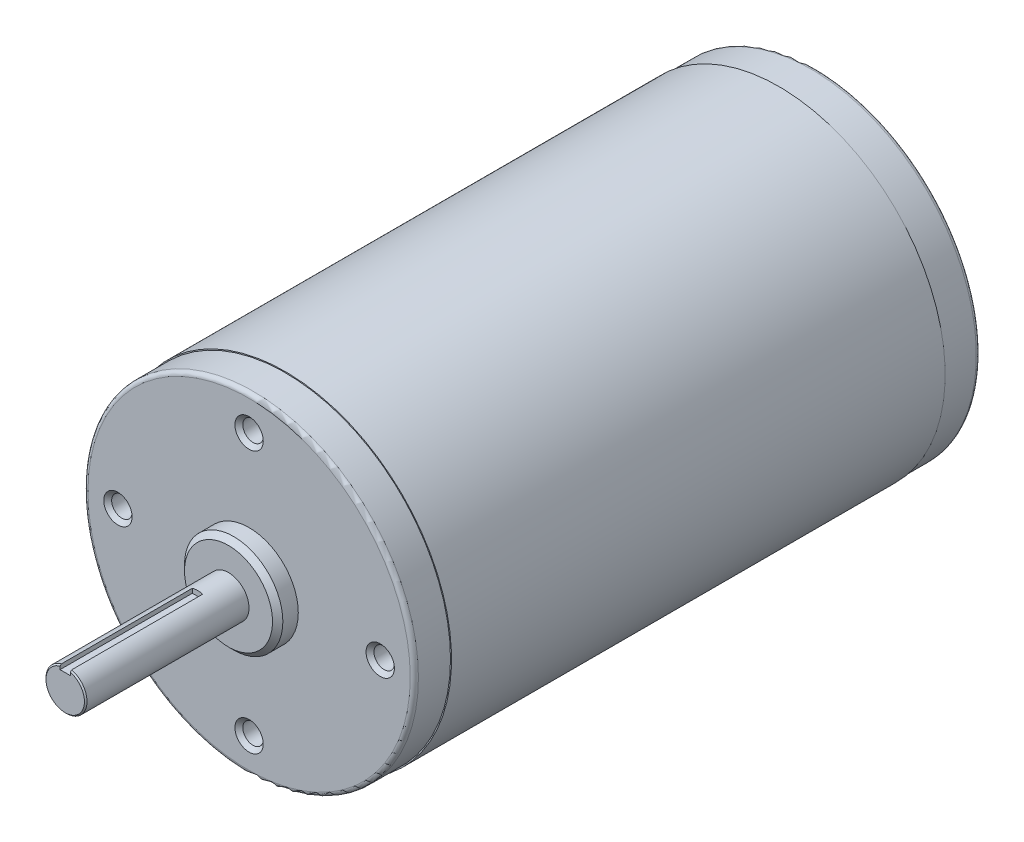
ISO-10303-21;
HEADER;
FILE_DESCRIPTION(('STEP AP214'),'2;1');
FILE_NAME('part.step','',(''),(''),'','','');
FILE_SCHEMA(('AUTOMOTIVE_DESIGN { 1 0 10303 214 1 1 1 1 }'));
ENDSEC;
DATA;
#1=APPLICATION_CONTEXT('core data for automotive mechanical design processes');
#2=APPLICATION_PROTOCOL_DEFINITION('international standard','automotive_design',2000,#1);
#3=PRODUCT_CONTEXT('',#1,'mechanical');
#4=PRODUCT('Part','Part','',(#3));
#5=PRODUCT_RELATED_PRODUCT_CATEGORY('part','',(#4));
#6=PRODUCT_DEFINITION_FORMATION('','',#4);
#7=PRODUCT_DEFINITION_CONTEXT('part definition',#1,'design');
#8=PRODUCT_DEFINITION('design','',#6,#7);
#9=PRODUCT_DEFINITION_SHAPE('','',#8);
#10=(LENGTH_UNIT() NAMED_UNIT(*) SI_UNIT(.MILLI.,.METRE.));
#11=(NAMED_UNIT(*) PLANE_ANGLE_UNIT() SI_UNIT($,.RADIAN.));
#12=(NAMED_UNIT(*) SI_UNIT($,.STERADIAN.) SOLID_ANGLE_UNIT());
#13=UNCERTAINTY_MEASURE_WITH_UNIT(LENGTH_MEASURE(1.E-05),#10,'distance_accuracy_value','');
#14=(GEOMETRIC_REPRESENTATION_CONTEXT(3) GLOBAL_UNCERTAINTY_ASSIGNED_CONTEXT((#13)) GLOBAL_UNIT_ASSIGNED_CONTEXT((#10,
#11,#12)) REPRESENTATION_CONTEXT('',''));
#15=CARTESIAN_POINT('',(0.,0.,0.));
#16=DIRECTION('',(0.,0.,1.));
#17=DIRECTION('',(1.,0.,0.));
#18=AXIS2_PLACEMENT_3D('',#15,#16,#17);
#19=CARTESIAN_POINT('',(-0.999999999999988,2.99999999999999,42.6108));
#20=DIRECTION('',(0.,-1.,0.));
#21=DIRECTION('',(0.,0.,-1.));
#22=AXIS2_PLACEMENT_3D('',#19,#20,#21);
#23=PLANE('',#22);
#24=DIRECTION('',(0.,0.,1.));
#25=VECTOR('',#24,1.);
#26=CARTESIAN_POINT('',(-0.999999999999988,2.99999999999999,42.6108));
#27=LINE('',#26,#25);
#28=CARTESIAN_POINT('',(-0.999999999999988,2.99999999999999,16.9822));
#29=VERTEX_POINT('',#28);
#30=CARTESIAN_POINT('',(-0.999999999999988,2.99999999999999,42.6108));
#31=VERTEX_POINT('',#30);
#32=EDGE_CURVE('E134',#29,#31,#27,.T.);
#33=ORIENTED_EDGE('',*,*,#32,.T.);
#34=DIRECTION('',(-1.,0.,0.));
#35=VECTOR('',#34,1.);
#36=CARTESIAN_POINT('',(0.,2.99999999999999,42.6108));
#37=LINE('',#36,#35);
#38=CARTESIAN_POINT('',(1.00000000000001,2.99999999999999,42.6108));
#39=VERTEX_POINT('',#38);
#40=EDGE_CURVE('E132',#31,#39,#37,.F.);
#41=ORIENTED_EDGE('',*,*,#40,.T.);
#42=DIRECTION('',(0.,0.,-1.));
#43=VECTOR('',#42,1.);
#44=CARTESIAN_POINT('',(1.00000000000001,2.99999999999999,42.6108));
#45=LINE('',#44,#43);
#46=CARTESIAN_POINT('',(1.00000000000001,2.99999999999999,16.9822));
#47=VERTEX_POINT('',#46);
#48=EDGE_CURVE('E121',#39,#47,#45,.T.);
#49=ORIENTED_EDGE('',*,*,#48,.T.);
#50=DIRECTION('',(1.,0.,0.));
#51=VECTOR('',#50,1.);
#52=CARTESIAN_POINT('',(0.,2.99999999999999,16.9822));
#53=LINE('',#52,#51);
#54=EDGE_CURVE('E101',#29,#47,#53,.T.);
#55=ORIENTED_EDGE('',*,*,#54,.F.);
#56=EDGE_LOOP('',(#33,#41,#49,#55));
#57=FACE_BOUND('',#56,.T.);
#58=ADVANCED_FACE('F15',(#57),#23,.F.);
#59=CARTESIAN_POINT('',(0.,0.,42.6108));
#60=DIRECTION('',(0.,0.,-1.));
#61=DIRECTION('',(-1.,0.,0.));
#62=AXIS2_PLACEMENT_3D('',#59,#60,#61);
#63=PLANE('',#62);
#64=DIRECTION('',(0.,1.,0.));
#65=VECTOR('',#64,1.);
#66=CARTESIAN_POINT('',(1.00000000000001,2.99999999999999,42.6108));
#67=LINE('',#66,#65);
#68=CARTESIAN_POINT('',(1.00000000000001,3.58836592498397,42.6108000000454));
#69=VERTEX_POINT('',#68);
#70=EDGE_CURVE('E118',#69,#39,#67,.F.);
#71=ORIENTED_EDGE('',*,*,#70,.T.);
#72=ORIENTED_EDGE('',*,*,#40,.F.);
#73=DIRECTION('',(0.,1.,0.));
#74=VECTOR('',#73,1.);
#75=CARTESIAN_POINT('',(-0.999999999999988,3.84726136491921,42.6108));
#76=LINE('',#75,#74);
#77=CARTESIAN_POINT('',(-0.999999999999988,3.58836592498397,42.6108000000454));
#78=VERTEX_POINT('',#77);
#79=EDGE_CURVE('E102',#31,#78,#76,.T.);
#80=ORIENTED_EDGE('',*,*,#79,.T.);
#81=CARTESIAN_POINT('',(0.,0.,42.6108000000909));
#82=DIRECTION('',(0.,0.,-1.));
#83=DIRECTION('',(-1.,0.,0.));
#84=AXIS2_PLACEMENT_3D('',#81,#82,#83);
#85=CIRCLE('',#84,3.72510000016746);
#86=EDGE_CURVE('E97',#69,#78,#85,.T.);
#87=ORIENTED_EDGE('',*,*,#86,.F.);
#88=EDGE_LOOP('',(#71,#72,#80,#87));
#89=FACE_BOUND('',#88,.T.);
#90=ADVANCED_FACE('F793',(#89),#63,.F.);
#91=CARTESIAN_POINT('',(-0.999999999999988,3.84726136491921,42.6108));
#92=DIRECTION('',(-1.,0.,0.));
#93=DIRECTION('',(0.,0.,1.));
#94=AXIS2_PLACEMENT_3D('',#91,#92,#93);
#95=PLANE('',#94);
#96=ORIENTED_EDGE('',*,*,#79,.F.);
#97=ORIENTED_EDGE('',*,*,#32,.F.);
#98=DIRECTION('',(0.,1.,0.));
#99=VECTOR('',#98,1.);
#100=CARTESIAN_POINT('',(-0.999999999999988,3.45234055060212,16.9822));
#101=LINE('',#100,#99);
#102=CARTESIAN_POINT('',(-0.999999999999988,3.84726136491921,16.9822));
#103=VERTEX_POINT('',#102);
#104=EDGE_CURVE('E107',#103,#29,#101,.F.);
#105=ORIENTED_EDGE('',*,*,#104,.F.);
#106=DIRECTION('',(0.,0.,1.));
#107=VECTOR('',#106,1.);
#108=CARTESIAN_POINT('',(-0.999999999999988,3.84726136491921,10.9878));
#109=LINE('',#108,#107);
#110=CARTESIAN_POINT('',(-0.999999999999988,3.84726136487013,42.3607999999493));
#111=VERTEX_POINT('',#110);
#112=EDGE_CURVE('E85',#111,#103,#109,.F.);
#113=ORIENTED_EDGE('',*,*,#112,.F.);
#114=CARTESIAN_POINT('',(-0.999999999958643,3.5883659248844,42.610800000094));
#115=CARTESIAN_POINT('',(-0.999999999979315,3.6315641260689,42.5691840357475));
#116=CARTESIAN_POINT('',(-0.999999999993097,3.67473784689741,42.5275427199908));
#117=CARTESIAN_POINT('',(-1.00000000000688,3.76103632687519,42.4442093865912));
#118=CARTESIAN_POINT('',(-1.00000000000688,3.80416108602558,42.4025173689494));
#119=CARTESIAN_POINT('',(-0.999999999999988,3.84726136482105,42.3607999998986));
#120=B_SPLINE_CURVE_WITH_KNOTS('',3,(#114,#115,#116,#117,#118,#119),.UNSPECIFIED.,.F.,.F.,(4,2,
4),(0.,0.179949226542119,0.359898449050626),.UNSPECIFIED.);
#121=EDGE_CURVE('E95',#78,#111,#120,.T.);
#122=ORIENTED_EDGE('',*,*,#121,.F.);
#123=EDGE_LOOP('',(#96,#97,#105,#113,#122));
#124=FACE_BOUND('',#123,.T.);
#125=ADVANCED_FACE('F104',(#124),#95,.F.);
#126=CARTESIAN_POINT('',(0.,3.45234055060212,16.9822));
#127=DIRECTION('',(0.,0.,1.));
#128=DIRECTION('',(1.,0.,0.));
#129=AXIS2_PLACEMENT_3D('',#126,#127,#128);
#130=PLANE('',#129);
#131=CARTESIAN_POINT('',(0.,0.,16.9822));
#132=DIRECTION('',(0.,0.,1.));
#133=DIRECTION('',(1.,0.,0.));
#134=AXIS2_PLACEMENT_3D('',#131,#132,#133);
#135=CIRCLE('',#134,3.9751);
#136=CARTESIAN_POINT('',(1.00000000000001,3.8472613649192,16.9822));
#137=VERTEX_POINT('',#136);
#138=EDGE_CURVE('E109',#103,#137,#135,.F.);
#139=ORIENTED_EDGE('',*,*,#138,.F.);
#140=ORIENTED_EDGE('',*,*,#104,.T.);
#141=ORIENTED_EDGE('',*,*,#54,.T.);
#142=DIRECTION('',(0.,1.,0.));
#143=VECTOR('',#142,1.);
#144=CARTESIAN_POINT('',(1.00000000000001,2.99999999999999,16.9822));
#145=LINE('',#144,#143);
#146=EDGE_CURVE('E129',#47,#137,#145,.T.);
#147=ORIENTED_EDGE('',*,*,#146,.T.);
#148=EDGE_LOOP('',(#139,#140,#141,#147));
#149=FACE_BOUND('',#148,.T.);
#150=ADVANCED_FACE('F768',(#149),#130,.T.);
#151=CARTESIAN_POINT('',(1.00000000000001,2.99999999999999,42.6108));
#152=DIRECTION('',(1.,0.,0.));
#153=DIRECTION('',(0.,0.,-1.));
#154=AXIS2_PLACEMENT_3D('',#151,#152,#153);
#155=PLANE('',#154);
#156=DIRECTION('',(0.,0.,1.));
#157=VECTOR('',#156,1.);
#158=CARTESIAN_POINT('',(1.00000000000001,3.8472613649192,10.9878));
#159=LINE('',#158,#157);
#160=CARTESIAN_POINT('',(1.00000000000001,3.84726136487822,42.3607999999415));
#161=VERTEX_POINT('',#160);
#162=EDGE_CURVE('E87',#137,#161,#159,.T.);
#163=ORIENTED_EDGE('',*,*,#162,.F.);
#164=ORIENTED_EDGE('',*,*,#146,.F.);
#165=ORIENTED_EDGE('',*,*,#48,.F.);
#166=ORIENTED_EDGE('',*,*,#70,.F.);
#167=CARTESIAN_POINT('',(1.00000000000001,3.84726136483723,42.3607999998829));
#168=CARTESIAN_POINT('',(1.00000000000001,3.80416108603627,42.4025173689311));
#169=CARTESIAN_POINT('',(1.00000000000001,3.76103632688435,42.4442093865744));
#170=CARTESIAN_POINT('',(1.00000000000001,3.67473784691138,42.5275427199852));
#171=CARTESIAN_POINT('',(1.00000000000001,3.63156412608924,42.5691840357516));
#172=CARTESIAN_POINT('',(1.00000000000001,3.58836592491504,42.6108000001118));
#173=B_SPLINE_CURVE_WITH_KNOTS('',3,(#167,#168,#169,#170,#171,#172),.UNSPECIFIED.,.F.,.F.,(4,2,
4),(0.,0.179949222514937,0.359898449063476),.UNSPECIFIED.);
#174=EDGE_CURVE('E112',#161,#69,#173,.T.);
#175=ORIENTED_EDGE('',*,*,#174,.F.);
#176=EDGE_LOOP('',(#163,#164,#165,#166,#175));
#177=FACE_BOUND('',#176,.T.);
#178=ADVANCED_FACE('F218',(#177),#155,.F.);
#179=CARTESIAN_POINT('',(0.,0.,42.3607999999831));
#180=DIRECTION('',(0.,0.,-1.));
#181=DIRECTION('',(-1.,0.,0.));
#182=AXIS2_PLACEMENT_3D('',#179,#180,#181);
#183=CONICAL_SURFACE('',#182,3.97509999982049,0.785398162487954);
#184=CARTESIAN_POINT('',(0.,0.,42.3608));
#185=DIRECTION('',(0.,0.,1.));
#186=DIRECTION('',(1.,0.,0.));
#187=AXIS2_PLACEMENT_3D('',#184,#185,#186);
#188=CIRCLE('',#187,3.9751);
#189=EDGE_CURVE('E80',#161,#111,#188,.F.);
#190=ORIENTED_EDGE('',*,*,#189,.F.);
#191=ORIENTED_EDGE('',*,*,#174,.T.);
#192=ORIENTED_EDGE('',*,*,#86,.T.);
#193=ORIENTED_EDGE('',*,*,#121,.T.);
#194=EDGE_LOOP('',(#190,#191,#192,#193));
#195=FACE_BOUND('',#194,.T.);
#196=ADVANCED_FACE('F96',(#195),#183,.T.);
#197=CARTESIAN_POINT('',(0.,25.4,-98.0336));
#198=DIRECTION('',(0.,0.,1.));
#199=DIRECTION('',(1.,0.,0.));
#200=AXIS2_PLACEMENT_3D('',#197,#198,#199);
#201=CYLINDRICAL_SURFACE('',#200,2.54);
#202=CARTESIAN_POINT('',(0.,25.4,-94.9856));
#203=DIRECTION('',(0.,0.,1.));
#204=DIRECTION('',(1.,0.,0.));
#205=AXIS2_PLACEMENT_3D('',#202,#203,#204);
#206=CIRCLE('',#205,2.54);
#207=CARTESIAN_POINT('',(2.54,25.4,-94.9856));
#208=VERTEX_POINT('',#207);
#209=EDGE_CURVE('E202',#208,#208,#206,.T.);
#210=ORIENTED_EDGE('',*,*,#209,.T.);
#211=EDGE_LOOP('',(#210));
#212=FACE_BOUND('',#211,.T.);
#213=CARTESIAN_POINT('',(0.,25.4,-98.0336));
#214=DIRECTION('',(0.,0.,1.));
#215=DIRECTION('',(1.,0.,0.));
#216=AXIS2_PLACEMENT_3D('',#213,#214,#215);
#217=CIRCLE('',#216,2.54);
#218=CARTESIAN_POINT('',(2.54,25.4,-98.0336));
#219=VERTEX_POINT('',#218);
#220=EDGE_CURVE('E203',#219,#219,#217,.F.);
#221=ORIENTED_EDGE('',*,*,#220,.T.);
#222=EDGE_LOOP('',(#221));
#223=FACE_BOUND('',#222,.T.);
#224=ADVANCED_FACE('F224',(#212,#223),#201,.F.);
#225=CARTESIAN_POINT('',(0.,0.,10.9878));
#226=DIRECTION('',(0.,0.,1.));
#227=DIRECTION('',(1.,0.,0.));
#228=AXIS2_PLACEMENT_3D('',#225,#226,#227);
#229=CYLINDRICAL_SURFACE('',#228,3.9751);
#230=CARTESIAN_POINT('',(0.,0.,10.9878));
#231=DIRECTION('',(0.,0.,1.));
#232=DIRECTION('',(1.,0.,0.));
#233=AXIS2_PLACEMENT_3D('',#230,#231,#232);
#234=CIRCLE('',#233,3.9751);
#235=CARTESIAN_POINT('',(3.9751,0.,10.9878));
#236=VERTEX_POINT('',#235);
#237=EDGE_CURVE('E199',#236,#236,#234,.T.);
#238=ORIENTED_EDGE('',*,*,#237,.T.);
#239=EDGE_LOOP('',(#238));
#240=FACE_BOUND('',#239,.T.);
#241=ORIENTED_EDGE('',*,*,#189,.T.);
#242=ORIENTED_EDGE('',*,*,#112,.T.);
#243=ORIENTED_EDGE('',*,*,#138,.T.);
#244=ORIENTED_EDGE('',*,*,#162,.T.);
#245=EDGE_LOOP('',(#241,#242,#243,#244));
#246=FACE_BOUND('',#245,.T.);
#247=ADVANCED_FACE('F82',(#240,#246),#229,.T.);
#248=CARTESIAN_POINT('',(0.,-25.4,-98.0336));
#249=DIRECTION('',(0.,0.,1.));
#250=DIRECTION('',(1.,0.,0.));
#251=AXIS2_PLACEMENT_3D('',#248,#249,#250);
#252=CYLINDRICAL_SURFACE('',#251,2.54);
#253=CARTESIAN_POINT('',(0.,-25.4,-94.9856));
#254=DIRECTION('',(0.,0.,1.));
#255=DIRECTION('',(1.,0.,0.));
#256=AXIS2_PLACEMENT_3D('',#253,#254,#255);
#257=CIRCLE('',#256,2.54);
#258=CARTESIAN_POINT('',(2.54,-25.4,-94.9856));
#259=VERTEX_POINT('',#258);
#260=EDGE_CURVE('E198',#259,#259,#257,.T.);
#261=ORIENTED_EDGE('',*,*,#260,.T.);
#262=EDGE_LOOP('',(#261));
#263=FACE_BOUND('',#262,.T.);
#264=CARTESIAN_POINT('',(0.,-25.4,-98.0336));
#265=DIRECTION('',(0.,0.,1.));
#266=DIRECTION('',(1.,0.,0.));
#267=AXIS2_PLACEMENT_3D('',#264,#265,#266);
#268=CIRCLE('',#267,2.54);
#269=CARTESIAN_POINT('',(2.54,-25.4,-98.0336));
#270=VERTEX_POINT('',#269);
#271=EDGE_CURVE('E91',#270,#270,#268,.F.);
#272=ORIENTED_EDGE('',*,*,#271,.T.);
#273=EDGE_LOOP('',(#272));
#274=FACE_BOUND('',#273,.T.);
#275=ADVANCED_FACE('F228',(#263,#274),#252,.F.);
#276=CARTESIAN_POINT('',(-4.953,-30.45206,-98.0336));
#277=DIRECTION('',(0.,0.,1.));
#278=DIRECTION('',(1.,0.,0.));
#279=AXIS2_PLACEMENT_3D('',#276,#277,#278);
#280=PLANE('',#279);
#281=ORIENTED_EDGE('',*,*,#271,.F.);
#282=EDGE_LOOP('',(#281));
#283=FACE_BOUND('',#282,.T.);
#284=CARTESIAN_POINT('',(0.,-25.4,-98.0336));
#285=DIRECTION('',(0.,0.,1.));
#286=DIRECTION('',(1.,0.,0.));
#287=AXIS2_PLACEMENT_3D('',#284,#285,#286);
#288=CIRCLE('',#287,4.953);
#289=CARTESIAN_POINT('',(4.953,-25.4,-98.0336));
#290=VERTEX_POINT('',#289);
#291=EDGE_CURVE('E194',#290,#290,#288,.F.);
#292=ORIENTED_EDGE('',*,*,#291,.T.);
#293=EDGE_LOOP('',(#292));
#294=FACE_BOUND('',#293,.T.);
#295=ADVANCED_FACE('F235',(#283,#294),#280,.F.);
#296=CARTESIAN_POINT('',(0.,0.,-106.7204));
#297=DIRECTION('',(0.,0.,1.));
#298=DIRECTION('',(1.,0.,0.));
#299=AXIS2_PLACEMENT_3D('',#296,#297,#298);
#300=PLANE('',#299);
#301=CARTESIAN_POINT('',(0.,0.,-106.7204));
#302=DIRECTION('',(0.,0.,1.));
#303=DIRECTION('',(1.,0.,0.));
#304=AXIS2_PLACEMENT_3D('',#301,#302,#303);
#305=CIRCLE('',#304,14.3129);
#306=CARTESIAN_POINT('',(14.3129,0.,-106.7204));
#307=VERTEX_POINT('',#306);
#308=CARTESIAN_POINT('',(-14.3129,0.,-106.7204));
#309=VERTEX_POINT('',#308);
#310=EDGE_CURVE('E197',#307,#309,#305,.T.);
#311=ORIENTED_EDGE('',*,*,#310,.F.);
#312=CARTESIAN_POINT('',(0.,0.,-106.7204));
#313=DIRECTION('',(0.,0.,1.));
#314=DIRECTION('',(-1.,0.,0.));
#315=AXIS2_PLACEMENT_3D('',#312,#313,#314);
#316=CIRCLE('',#315,14.3129);
#317=EDGE_CURVE('E193',#309,#307,#316,.T.);
#318=ORIENTED_EDGE('',*,*,#317,.F.);
#319=EDGE_LOOP('',(#311,#318));
#320=FACE_BOUND('',#319,.T.);
#321=ADVANCED_FACE('F230',(#320),#300,.F.);
#322=CARTESIAN_POINT('',(4.953,30.45206,-98.0336));
#323=DIRECTION('',(0.,0.,1.));
#324=DIRECTION('',(-1.,0.,0.));
#325=AXIS2_PLACEMENT_3D('',#322,#323,#324);
#326=PLANE('',#325);
#327=ORIENTED_EDGE('',*,*,#220,.F.);
#328=EDGE_LOOP('',(#327));
#329=FACE_BOUND('',#328,.T.);
#330=CARTESIAN_POINT('',(0.,25.4,-98.0336));
#331=DIRECTION('',(0.,0.,1.));
#332=DIRECTION('',(1.,0.,0.));
#333=AXIS2_PLACEMENT_3D('',#330,#331,#332);
#334=CIRCLE('',#333,4.953);
#335=CARTESIAN_POINT('',(4.953,25.4,-98.0336));
#336=VERTEX_POINT('',#335);
#337=EDGE_CURVE('E190',#336,#336,#334,.F.);
#338=ORIENTED_EDGE('',*,*,#337,.T.);
#339=EDGE_LOOP('',(#338));
#340=FACE_BOUND('',#339,.T.);
#341=ADVANCED_FACE('F234',(#329,#340),#326,.F.);
#342=CARTESIAN_POINT('',(0.,25.4,-94.9856));
#343=DIRECTION('',(0.,0.,-1.));
#344=DIRECTION('',(-1.,0.,0.));
#345=AXIS2_PLACEMENT_3D('',#342,#343,#344);
#346=CONICAL_SURFACE('',#345,2.54,1.02974425867665);
#347=CARTESIAN_POINT('',(0.,25.4,-94.6498390860874));
#348=DIRECTION('',(0.,0.,1.));
#349=DIRECTION('',(1.,0.,0.));
#350=AXIS2_PLACEMENT_3D('',#347,#348,#349);
#351=CIRCLE('',#350,1.9812);
#352=CARTESIAN_POINT('',(1.9812,25.4,-94.6498390860874));
#353=VERTEX_POINT('',#352);
#354=EDGE_CURVE('E189',#353,#353,#351,.T.);
#355=ORIENTED_EDGE('',*,*,#354,.T.);
#356=EDGE_LOOP('',(#355));
#357=FACE_BOUND('',#356,.T.);
#358=ORIENTED_EDGE('',*,*,#209,.F.);
#359=EDGE_LOOP('',(#358));
#360=FACE_BOUND('',#359,.T.);
#361=ADVANCED_FACE('F628',(#357,#360),#346,.F.);
#362=CARTESIAN_POINT('',(0.,0.,-95.6056));
#363=DIRECTION('',(0.,0.,1.));
#364=DIRECTION('',(1.,0.,0.));
#365=AXIS2_PLACEMENT_3D('',#362,#363,#364);
#366=PLANE('',#365);
#367=CARTESIAN_POINT('',(25.4,0.,-95.6056));
#368=DIRECTION('',(0.,0.,-1.));
#369=DIRECTION('',(-1.,0.,0.));
#370=AXIS2_PLACEMENT_3D('',#367,#368,#369);
#371=CIRCLE('',#370,1.9812);
#372=CARTESIAN_POINT('',(23.4188,0.,-95.6056));
#373=VERTEX_POINT('',#372);
#374=EDGE_CURVE('E186',#373,#373,#371,.F.);
#375=ORIENTED_EDGE('',*,*,#374,.T.);
#376=EDGE_LOOP('',(#375));
#377=FACE_BOUND('',#376,.T.);
#378=ADVANCED_FACE('F237',(#377),#366,.T.);
#379=CARTESIAN_POINT('',(0.,0.,10.9878));
#380=DIRECTION('',(0.,0.,-1.));
#381=DIRECTION('',(-1.,0.,0.));
#382=AXIS2_PLACEMENT_3D('',#379,#380,#381);
#383=PLANE('',#382);
#384=ORIENTED_EDGE('',*,*,#237,.F.);
#385=EDGE_LOOP('',(#384));
#386=FACE_BOUND('',#385,.T.);
#387=CARTESIAN_POINT('',(0.,0.,10.9878000004487));
#388=DIRECTION('',(0.,0.,-1.));
#389=DIRECTION('',(-1.,0.,0.));
#390=AXIS2_PLACEMENT_3D('',#387,#388,#389);
#391=CIRCLE('',#390,8.52500000044874);
#392=CARTESIAN_POINT('',(-8.52500000044874,0.,10.9878000004487));
#393=VERTEX_POINT('',#392);
#394=EDGE_CURVE('E183',#393,#393,#391,.T.);
#395=ORIENTED_EDGE('',*,*,#394,.F.);
#396=EDGE_LOOP('',(#395));
#397=FACE_BOUND('',#396,.T.);
#398=ADVANCED_FACE('F583',(#386,#397),#383,.F.);
#399=CARTESIAN_POINT('',(0.,-25.4,-94.9856));
#400=DIRECTION('',(0.,0.,-1.));
#401=DIRECTION('',(-1.,0.,0.));
#402=AXIS2_PLACEMENT_3D('',#399,#400,#401);
#403=CONICAL_SURFACE('',#402,2.54,1.02974425867665);
#404=CARTESIAN_POINT('',(0.,-25.4,-94.6498390860874));
#405=DIRECTION('',(0.,0.,1.));
#406=DIRECTION('',(1.,0.,0.));
#407=AXIS2_PLACEMENT_3D('',#404,#405,#406);
#408=CIRCLE('',#407,1.9812);
#409=CARTESIAN_POINT('',(1.98119999999999,-25.4,-94.6498390860874));
#410=VERTEX_POINT('',#409);
#411=EDGE_CURVE('E182',#410,#410,#408,.T.);
#412=ORIENTED_EDGE('',*,*,#411,.T.);
#413=EDGE_LOOP('',(#412));
#414=FACE_BOUND('',#413,.T.);
#415=ORIENTED_EDGE('',*,*,#260,.F.);
#416=EDGE_LOOP('',(#415));
#417=FACE_BOUND('',#416,.T.);
#418=ADVANCED_FACE('F578',(#414,#417),#403,.F.);
#419=CARTESIAN_POINT('',(0.,0.,0.));
#420=DIRECTION('',(0.,0.,1.));
#421=DIRECTION('',(1.,0.,0.));
#422=AXIS2_PLACEMENT_3D('',#419,#420,#421);
#423=PLANE('',#422);
#424=CARTESIAN_POINT('',(-25.4,0.,0.));
#425=DIRECTION('',(0.,0.,-1.));
#426=DIRECTION('',(0.,1.,0.));
#427=AXIS2_PLACEMENT_3D('',#424,#425,#426);
#428=CIRCLE('',#427,1.9812);
#429=CARTESIAN_POINT('',(-25.4,1.9812,0.));
#430=VERTEX_POINT('',#429);
#431=EDGE_CURVE('E178',#430,#430,#428,.F.);
#432=ORIENTED_EDGE('',*,*,#431,.T.);
#433=EDGE_LOOP('',(#432));
#434=FACE_BOUND('',#433,.T.);
#435=ADVANCED_FACE('F278',(#434),#423,.T.);
#436=CARTESIAN_POINT('',(0.,-25.4,-102.0976));
#437=DIRECTION('',(0.,0.,1.));
#438=DIRECTION('',(1.,0.,0.));
#439=AXIS2_PLACEMENT_3D('',#436,#437,#438);
#440=CYLINDRICAL_SURFACE('',#439,4.953);
#441=CARTESIAN_POINT('',(0.,-25.4,-102.097599999809));
#442=DIRECTION('',(0.,0.,-1.));
#443=DIRECTION('',(-1.,0.,0.));
#444=AXIS2_PLACEMENT_3D('',#441,#442,#443);
#445=CIRCLE('',#444,4.9530000002278);
#446=CARTESIAN_POINT('',(-4.9530000002278,-25.4,-102.097599999809));
#447=VERTEX_POINT('',#446);
#448=EDGE_CURVE('E181',#447,#447,#445,.T.);
#449=ORIENTED_EDGE('',*,*,#448,.T.);
#450=EDGE_LOOP('',(#449));
#451=FACE_BOUND('',#450,.T.);
#452=ORIENTED_EDGE('',*,*,#291,.F.);
#453=EDGE_LOOP('',(#452));
#454=FACE_BOUND('',#453,.T.);
#455=ADVANCED_FACE('F274',(#451,#454),#440,.F.);
#456=CARTESIAN_POINT('',(0.,0.,-105.9584));
#457=DIRECTION('',(0.,0.,1.));
#458=DIRECTION('',(1.,0.,0.));
#459=AXIS2_PLACEMENT_3D('',#456,#457,#458);
#460=TOROIDAL_SURFACE('',#459,14.3129,0.762);
#461=CARTESIAN_POINT('',(0.,0.,-105.9584));
#462=DIRECTION('',(0.,0.,-1.));
#463=DIRECTION('',(-1.,0.,0.));
#464=AXIS2_PLACEMENT_3D('',#461,#462,#463);
#465=CIRCLE('',#464,15.0749);
#466=CARTESIAN_POINT('',(-15.0749,0.,-105.9584));
#467=VERTEX_POINT('',#466);
#468=EDGE_CURVE('E285',#467,#467,#465,.F.);
#469=ORIENTED_EDGE('',*,*,#468,.F.);
#470=EDGE_LOOP('',(#469));
#471=FACE_BOUND('',#470,.T.);
#472=ORIENTED_EDGE('',*,*,#317,.T.);
#473=ORIENTED_EDGE('',*,*,#310,.T.);
#474=EDGE_LOOP('',(#472,#473));
#475=FACE_BOUND('',#474,.T.);
#476=ADVANCED_FACE('F262',(#471,#475),#460,.T.);
#477=CARTESIAN_POINT('',(0.,25.4,-102.0976));
#478=DIRECTION('',(0.,0.,1.));
#479=DIRECTION('',(1.,0.,0.));
#480=AXIS2_PLACEMENT_3D('',#477,#478,#479);
#481=CYLINDRICAL_SURFACE('',#480,4.953);
#482=CARTESIAN_POINT('',(0.,25.4,-102.097599999809));
#483=DIRECTION('',(0.,0.,-1.));
#484=DIRECTION('',(1.,0.,0.));
#485=AXIS2_PLACEMENT_3D('',#482,#483,#484);
#486=CIRCLE('',#485,4.9530000002278);
#487=CARTESIAN_POINT('',(4.9530000002278,25.4,-102.097599999809));
#488=VERTEX_POINT('',#487);
#489=EDGE_CURVE('E283',#488,#488,#486,.T.);
#490=ORIENTED_EDGE('',*,*,#489,.T.);
#491=EDGE_LOOP('',(#490));
#492=FACE_BOUND('',#491,.T.);
#493=ORIENTED_EDGE('',*,*,#337,.F.);
#494=EDGE_LOOP('',(#493));
#495=FACE_BOUND('',#494,.T.);
#496=ADVANCED_FACE('F273',(#492,#495),#481,.F.);
#497=CARTESIAN_POINT('',(0.,25.4,6.23799999999999));
#498=DIRECTION('',(0.,0.,-1.));
#499=DIRECTION('',(-1.,0.,0.));
#500=AXIS2_PLACEMENT_3D('',#497,#498,#499);
#501=CYLINDRICAL_SURFACE('',#500,1.9812);
#502=CARTESIAN_POINT('',(0.,25.4,6.23799999959829));
#503=DIRECTION('',(0.,0.,1.));
#504=DIRECTION('',(0.,-1.,0.));
#505=AXIS2_PLACEMENT_3D('',#502,#503,#504);
#506=CIRCLE('',#505,1.98120000033932);
#507=CARTESIAN_POINT('',(0.,23.4187999996607,6.23799999959829));
#508=VERTEX_POINT('',#507);
#509=EDGE_CURVE('E404',#508,#508,#506,.T.);
#510=ORIENTED_EDGE('',*,*,#509,.T.);
#511=EDGE_LOOP('',(#510));
#512=FACE_BOUND('',#511,.T.);
#513=ORIENTED_EDGE('',*,*,#354,.F.);
#514=EDGE_LOOP('',(#513));
#515=FACE_BOUND('',#514,.T.);
#516=ADVANCED_FACE('F659',(#512,#515),#501,.F.);
#517=CARTESIAN_POINT('',(25.4,0.,6.23799999999999));
#518=DIRECTION('',(0.,0.,-1.));
#519=DIRECTION('',(-1.,0.,0.));
#520=AXIS2_PLACEMENT_3D('',#517,#518,#519);
#521=CYLINDRICAL_SURFACE('',#520,1.9812);
#522=CARTESIAN_POINT('',(25.4,0.,6.23799999959829));
#523=DIRECTION('',(0.,0.,1.));
#524=DIRECTION('',(-1.,0.,0.));
#525=AXIS2_PLACEMENT_3D('',#522,#523,#524);
#526=CIRCLE('',#525,1.98120000033932);
#527=CARTESIAN_POINT('',(23.4187999996607,0.,6.23799999959829));
#528=VERTEX_POINT('',#527);
#529=EDGE_CURVE('E402',#528,#528,#526,.T.);
#530=ORIENTED_EDGE('',*,*,#529,.T.);
#531=EDGE_LOOP('',(#530));
#532=FACE_BOUND('',#531,.T.);
#533=ORIENTED_EDGE('',*,*,#374,.F.);
#534=EDGE_LOOP('',(#533));
#535=FACE_BOUND('',#534,.T.);
#536=ADVANCED_FACE('F663',(#532,#535),#521,.F.);
#537=CARTESIAN_POINT('',(0.,0.,9.98779999955128));
#538=DIRECTION('',(0.,0.,-1.));
#539=DIRECTION('',(-1.,0.,0.));
#540=AXIS2_PLACEMENT_3D('',#537,#538,#539);
#541=CONICAL_SURFACE('',#540,9.52499999955128,0.7853981625);
#542=CARTESIAN_POINT('',(0.,0.,9.9878));
#543=DIRECTION('',(0.,0.,1.));
#544=DIRECTION('',(1.,0.,0.));
#545=AXIS2_PLACEMENT_3D('',#542,#543,#544);
#546=CIRCLE('',#545,9.525);
#547=CARTESIAN_POINT('',(9.525,0.,9.9878));
#548=VERTEX_POINT('',#547);
#549=EDGE_CURVE('E399',#548,#548,#546,.F.);
#550=ORIENTED_EDGE('',*,*,#549,.F.);
#551=EDGE_LOOP('',(#550));
#552=FACE_BOUND('',#551,.T.);
#553=ORIENTED_EDGE('',*,*,#394,.T.);
#554=EDGE_LOOP('',(#553));
#555=FACE_BOUND('',#554,.T.);
#556=ADVANCED_FACE('F276',(#552,#555),#541,.T.);
#557=CARTESIAN_POINT('',(0.,-25.4,6.23799999999999));
#558=DIRECTION('',(0.,0.,-1.));
#559=DIRECTION('',(-1.,0.,0.));
#560=AXIS2_PLACEMENT_3D('',#557,#558,#559);
#561=CYLINDRICAL_SURFACE('',#560,1.9812);
#562=CARTESIAN_POINT('',(0.,-25.4,6.23799999959829));
#563=DIRECTION('',(0.,0.,1.));
#564=DIRECTION('',(0.,1.,0.));
#565=AXIS2_PLACEMENT_3D('',#562,#563,#564);
#566=CIRCLE('',#565,1.98120000033932);
#567=CARTESIAN_POINT('',(0.,-23.4187999996607,6.23799999959829));
#568=VERTEX_POINT('',#567);
#569=EDGE_CURVE('E396',#568,#568,#566,.T.);
#570=ORIENTED_EDGE('',*,*,#569,.T.);
#571=EDGE_LOOP('',(#570));
#572=FACE_BOUND('',#571,.T.);
#573=ORIENTED_EDGE('',*,*,#411,.F.);
#574=EDGE_LOOP('',(#573));
#575=FACE_BOUND('',#574,.T.);
#576=ADVANCED_FACE('F435',(#572,#575),#561,.F.);
#577=CARTESIAN_POINT('',(-25.4,0.,6.23799999999999));
#578=DIRECTION('',(0.,0.,-1.));
#579=DIRECTION('',(0.,1.,0.));
#580=AXIS2_PLACEMENT_3D('',#577,#578,#579);
#581=CYLINDRICAL_SURFACE('',#580,1.9812);
#582=CARTESIAN_POINT('',(-25.4,0.,6.23799999959829));
#583=DIRECTION('',(0.,0.,1.));
#584=DIRECTION('',(1.,0.,0.));
#585=AXIS2_PLACEMENT_3D('',#582,#583,#584);
#586=CIRCLE('',#585,1.98120000033932);
#587=CARTESIAN_POINT('',(-23.4187999996607,0.,6.23799999959829));
#588=VERTEX_POINT('',#587);
#589=EDGE_CURVE('E177',#588,#588,#586,.T.);
#590=ORIENTED_EDGE('',*,*,#589,.T.);
#591=EDGE_LOOP('',(#590));
#592=FACE_BOUND('',#591,.T.);
#593=ORIENTED_EDGE('',*,*,#431,.F.);
#594=EDGE_LOOP('',(#593));
#595=FACE_BOUND('',#594,.T.);
#596=ADVANCED_FACE('F17',(#592,#595),#581,.F.);
#597=CARTESIAN_POINT('',(0.,-25.4,-102.605600000174));
#598=DIRECTION('',(0.,0.,-1.));
#599=DIRECTION('',(0.,1.,0.));
#600=AXIS2_PLACEMENT_3D('',#597,#598,#599);
#601=CONICAL_SURFACE('',#600,5.46099999962735,0.785398162502275);
#602=ORIENTED_EDGE('',*,*,#448,.F.);
#603=EDGE_LOOP('',(#602));
#604=FACE_BOUND('',#603,.T.);
#605=CARTESIAN_POINT('',(0.,-25.4,-102.605600000288));
#606=DIRECTION('',(0.,0.,-1.));
#607=DIRECTION('',(0.,1.,0.));
#608=AXIS2_PLACEMENT_3D('',#605,#606,#607);
#609=CIRCLE('',#608,5.46099999974103);
#610=CARTESIAN_POINT('',(0.,-19.939000000259,-102.605600000288));
#611=VERTEX_POINT('',#610);
#612=EDGE_CURVE('E174',#611,#611,#609,.T.);
#613=ORIENTED_EDGE('',*,*,#612,.T.);
#614=EDGE_LOOP('',(#613));
#615=FACE_BOUND('',#614,.T.);
#616=ADVANCED_FACE('F425',(#604,#615),#601,.F.);
#617=CARTESIAN_POINT('',(0.,0.,-102.6056));
#618=DIRECTION('',(0.,0.,-1.));
#619=DIRECTION('',(-1.,0.,0.));
#620=AXIS2_PLACEMENT_3D('',#617,#618,#619);
#621=CYLINDRICAL_SURFACE('',#620,15.0749);
#622=CARTESIAN_POINT('',(0.,0.,-102.6056));
#623=DIRECTION('',(0.,0.,-1.));
#624=DIRECTION('',(-1.,0.,0.));
#625=AXIS2_PLACEMENT_3D('',#622,#623,#624);
#626=CIRCLE('',#625,15.0749);
#627=CARTESIAN_POINT('',(-15.0749,0.,-102.6056));
#628=VERTEX_POINT('',#627);
#629=EDGE_CURVE('E171',#628,#628,#626,.T.);
#630=ORIENTED_EDGE('',*,*,#629,.T.);
#631=EDGE_LOOP('',(#630));
#632=FACE_BOUND('',#631,.T.);
#633=ORIENTED_EDGE('',*,*,#468,.T.);
#634=EDGE_LOOP('',(#633));
#635=FACE_BOUND('',#634,.T.);
#636=ADVANCED_FACE('F417',(#632,#635),#621,.T.);
#637=CARTESIAN_POINT('',(0.,25.4,-102.605600000174));
#638=DIRECTION('',(0.,0.,-1.));
#639=DIRECTION('',(0.,1.,0.));
#640=AXIS2_PLACEMENT_3D('',#637,#638,#639);
#641=CONICAL_SURFACE('',#640,5.46099999962734,0.785398162502276);
#642=ORIENTED_EDGE('',*,*,#489,.F.);
#643=EDGE_LOOP('',(#642));
#644=FACE_BOUND('',#643,.T.);
#645=CARTESIAN_POINT('',(0.,25.4,-102.605600000288));
#646=DIRECTION('',(0.,0.,-1.));
#647=DIRECTION('',(0.,1.,0.));
#648=AXIS2_PLACEMENT_3D('',#645,#646,#647);
#649=CIRCLE('',#648,5.46099999974103);
#650=CARTESIAN_POINT('',(0.,30.860999999741,-102.605600000288));
#651=VERTEX_POINT('',#650);
#652=EDGE_CURVE('E168',#651,#651,#649,.T.);
#653=ORIENTED_EDGE('',*,*,#652,.T.);
#654=EDGE_LOOP('',(#653));
#655=FACE_BOUND('',#654,.T.);
#656=ADVANCED_FACE('F413',(#644,#655),#641,.F.);
#657=CARTESIAN_POINT('',(0.,25.4,7.00000000034606));
#658=DIRECTION('',(0.,0.,1.));
#659=DIRECTION('',(1.,0.,0.));
#660=AXIS2_PLACEMENT_3D('',#657,#658,#659);
#661=CONICAL_SURFACE('',#660,2.74319999966602,0.785398162464978);
#662=ORIENTED_EDGE('',*,*,#509,.F.);
#663=EDGE_LOOP('',(#662));
#664=FACE_BOUND('',#663,.T.);
#665=CARTESIAN_POINT('',(0.,25.4,7.00000000034606));
#666=DIRECTION('',(0.,0.,1.));
#667=DIRECTION('',(1.,0.,0.));
#668=AXIS2_PLACEMENT_3D('',#665,#666,#667);
#669=CIRCLE('',#668,2.74319999966602);
#670=CARTESIAN_POINT('',(2.74319999966602,25.4,7.00000000034606));
#671=VERTEX_POINT('',#670);
#672=EDGE_CURVE('E165',#671,#671,#669,.T.);
#673=ORIENTED_EDGE('',*,*,#672,.T.);
#674=EDGE_LOOP('',(#673));
#675=FACE_BOUND('',#674,.T.);
#676=ADVANCED_FACE('F416',(#664,#675),#661,.F.);
#677=CARTESIAN_POINT('',(25.4,0.,7.00000000034606));
#678=DIRECTION('',(0.,0.,1.));
#679=DIRECTION('',(1.,0.,0.));
#680=AXIS2_PLACEMENT_3D('',#677,#678,#679);
#681=CONICAL_SURFACE('',#680,2.74319999966602,0.785398162464978);
#682=ORIENTED_EDGE('',*,*,#529,.F.);
#683=EDGE_LOOP('',(#682));
#684=FACE_BOUND('',#683,.T.);
#685=CARTESIAN_POINT('',(25.4,0.,7.00000000034606));
#686=DIRECTION('',(0.,0.,1.));
#687=DIRECTION('',(1.,0.,0.));
#688=AXIS2_PLACEMENT_3D('',#685,#686,#687);
#689=CIRCLE('',#688,2.74319999966602);
#690=CARTESIAN_POINT('',(28.143199999666,0.,7.00000000034606));
#691=VERTEX_POINT('',#690);
#692=EDGE_CURVE('E162',#691,#691,#689,.T.);
#693=ORIENTED_EDGE('',*,*,#692,.T.);
#694=EDGE_LOOP('',(#693));
#695=FACE_BOUND('',#694,.T.);
#696=ADVANCED_FACE('F527',(#684,#695),#681,.F.);
#697=CARTESIAN_POINT('',(0.,0.,6.99999999999999));
#698=DIRECTION('',(0.,0.,1.));
#699=DIRECTION('',(1.,0.,0.));
#700=AXIS2_PLACEMENT_3D('',#697,#698,#699);
#701=CYLINDRICAL_SURFACE('',#700,9.525);
#702=CARTESIAN_POINT('',(0.,0.,6.99999999999999));
#703=DIRECTION('',(0.,0.,1.));
#704=DIRECTION('',(1.,0.,0.));
#705=AXIS2_PLACEMENT_3D('',#702,#703,#704);
#706=CIRCLE('',#705,9.525);
#707=CARTESIAN_POINT('',(9.525,0.,6.99999999999999));
#708=VERTEX_POINT('',#707);
#709=EDGE_CURVE('E159',#708,#708,#706,.T.);
#710=ORIENTED_EDGE('',*,*,#709,.T.);
#711=EDGE_LOOP('',(#710));
#712=FACE_BOUND('',#711,.T.);
#713=ORIENTED_EDGE('',*,*,#549,.T.);
#714=EDGE_LOOP('',(#713));
#715=FACE_BOUND('',#714,.T.);
#716=ADVANCED_FACE('F519',(#712,#715),#701,.T.);
#717=CARTESIAN_POINT('',(0.,-25.4,7.00000000034606));
#718=DIRECTION('',(0.,0.,1.));
#719=DIRECTION('',(1.,0.,0.));
#720=AXIS2_PLACEMENT_3D('',#717,#718,#719);
#721=CONICAL_SURFACE('',#720,2.74319999966602,0.785398162464978);
#722=ORIENTED_EDGE('',*,*,#569,.F.);
#723=EDGE_LOOP('',(#722));
#724=FACE_BOUND('',#723,.T.);
#725=CARTESIAN_POINT('',(0.,-25.4,7.00000000034606));
#726=DIRECTION('',(0.,0.,1.));
#727=DIRECTION('',(1.,0.,0.));
#728=AXIS2_PLACEMENT_3D('',#725,#726,#727);
#729=CIRCLE('',#728,2.74319999966602);
#730=CARTESIAN_POINT('',(2.74319999966601,-25.4,7.00000000034606));
#731=VERTEX_POINT('',#730);
#732=EDGE_CURVE('E156',#731,#731,#729,.T.);
#733=ORIENTED_EDGE('',*,*,#732,.T.);
#734=EDGE_LOOP('',(#733));
#735=FACE_BOUND('',#734,.T.);
#736=ADVANCED_FACE('F510',(#724,#735),#721,.F.);
#737=CARTESIAN_POINT('',(-25.4,0.,7.00000000034606));
#738=DIRECTION('',(0.,0.,1.));
#739=DIRECTION('',(1.,0.,0.));
#740=AXIS2_PLACEMENT_3D('',#737,#738,#739);
#741=CONICAL_SURFACE('',#740,2.74319999966602,0.785398162464978);
#742=ORIENTED_EDGE('',*,*,#589,.F.);
#743=EDGE_LOOP('',(#742));
#744=FACE_BOUND('',#743,.T.);
#745=CARTESIAN_POINT('',(-25.4,0.,7.00000000034606));
#746=DIRECTION('',(0.,0.,1.));
#747=DIRECTION('',(1.,0.,0.));
#748=AXIS2_PLACEMENT_3D('',#745,#746,#747);
#749=CIRCLE('',#748,2.74319999966602);
#750=CARTESIAN_POINT('',(-22.656800000334,0.,7.00000000034606));
#751=VERTEX_POINT('',#750);
#752=EDGE_CURVE('E152',#751,#751,#749,.T.);
#753=ORIENTED_EDGE('',*,*,#752,.T.);
#754=EDGE_LOOP('',(#753));
#755=FACE_BOUND('',#754,.T.);
#756=ADVANCED_FACE('F372',(#744,#755),#741,.F.);
#757=CARTESIAN_POINT('',(0.,0.,-102.6056));
#758=DIRECTION('',(0.,0.,1.));
#759=DIRECTION('',(1.,0.,0.));
#760=AXIS2_PLACEMENT_3D('',#757,#758,#759);
#761=PLANE('',#760);
#762=ORIENTED_EDGE('',*,*,#652,.F.);
#763=EDGE_LOOP('',(#762));
#764=FACE_BOUND('',#763,.T.);
#765=ORIENTED_EDGE('',*,*,#629,.F.);
#766=EDGE_LOOP('',(#765));
#767=FACE_BOUND('',#766,.T.);
#768=ORIENTED_EDGE('',*,*,#612,.F.);
#769=EDGE_LOOP('',(#768));
#770=FACE_BOUND('',#769,.T.);
#771=CARTESIAN_POINT('',(0.,0.,-102.6056));
#772=DIRECTION('',(0.,0.,1.));
#773=DIRECTION('',(1.,0.,0.));
#774=AXIS2_PLACEMENT_3D('',#771,#772,#773);
#775=CIRCLE('',#774,31.242);
#776=CARTESIAN_POINT('',(31.242,0.,-102.6056));
#777=VERTEX_POINT('',#776);
#778=CARTESIAN_POINT('',(-31.242,0.,-102.6056));
#779=VERTEX_POINT('',#778);
#780=EDGE_CURVE('E155',#777,#779,#775,.T.);
#781=ORIENTED_EDGE('',*,*,#780,.F.);
#782=CARTESIAN_POINT('',(0.,0.,-102.6056));
#783=DIRECTION('',(0.,0.,1.));
#784=DIRECTION('',(-1.,0.,0.));
#785=AXIS2_PLACEMENT_3D('',#782,#783,#784);
#786=CIRCLE('',#785,31.242);
#787=EDGE_CURVE('E385',#779,#777,#786,.T.);
#788=ORIENTED_EDGE('',*,*,#787,.F.);
#789=EDGE_LOOP('',(#781,#788));
#790=FACE_BOUND('',#789,.T.);
#791=ADVANCED_FACE('F363',(#764,#767,#770,#790),#761,.F.);
#792=CARTESIAN_POINT('',(0.,0.,6.99999999999999));
#793=DIRECTION('',(0.,0.,-1.));
#794=DIRECTION('',(-1.,0.,0.));
#795=AXIS2_PLACEMENT_3D('',#792,#793,#794);
#796=PLANE('',#795);
#797=ORIENTED_EDGE('',*,*,#752,.F.);
#798=EDGE_LOOP('',(#797));
#799=FACE_BOUND('',#798,.T.);
#800=ORIENTED_EDGE('',*,*,#732,.F.);
#801=EDGE_LOOP('',(#800));
#802=FACE_BOUND('',#801,.T.);
#803=ORIENTED_EDGE('',*,*,#709,.F.);
#804=EDGE_LOOP('',(#803));
#805=FACE_BOUND('',#804,.T.);
#806=ORIENTED_EDGE('',*,*,#692,.F.);
#807=EDGE_LOOP('',(#806));
#808=FACE_BOUND('',#807,.T.);
#809=ORIENTED_EDGE('',*,*,#672,.F.);
#810=EDGE_LOOP('',(#809));
#811=FACE_BOUND('',#810,.T.);
#812=CARTESIAN_POINT('',(0.,0.,6.99999999999999));
#813=DIRECTION('',(0.,0.,-1.));
#814=DIRECTION('',(-1.,0.,0.));
#815=AXIS2_PLACEMENT_3D('',#812,#813,#814);
#816=CIRCLE('',#815,31.21025);
#817=CARTESIAN_POINT('',(-31.21025,0.,6.99999999999999));
#818=VERTEX_POINT('',#817);
#819=CARTESIAN_POINT('',(31.21025,0.,6.99999999999999));
#820=VERTEX_POINT('',#819);
#821=EDGE_CURVE('E327',#818,#820,#816,.T.);
#822=ORIENTED_EDGE('',*,*,#821,.F.);
#823=CARTESIAN_POINT('',(0.,0.,6.99999999999999));
#824=DIRECTION('',(0.,0.,-1.));
#825=DIRECTION('',(1.,0.,0.));
#826=AXIS2_PLACEMENT_3D('',#823,#824,#825);
#827=CIRCLE('',#826,31.21025);
#828=EDGE_CURVE('E35',#820,#818,#827,.T.);
#829=ORIENTED_EDGE('',*,*,#828,.F.);
#830=EDGE_LOOP('',(#822,#829));
#831=FACE_BOUND('',#830,.T.);
#832=ADVANCED_FACE('F311',(#799,#802,#805,#808,#811,#831),#796,.F.);
#833=CARTESIAN_POINT('',(0.,0.,-101.8436));
#834=DIRECTION('',(0.,0.,1.));
#835=DIRECTION('',(1.,0.,0.));
#836=AXIS2_PLACEMENT_3D('',#833,#834,#835);
#837=TOROIDAL_SURFACE('',#836,31.242,0.762);
#838=CARTESIAN_POINT('',(0.,0.,-101.8436));
#839=DIRECTION('',(0.,0.,-1.));
#840=DIRECTION('',(-1.,0.,0.));
#841=AXIS2_PLACEMENT_3D('',#838,#839,#840);
#842=CIRCLE('',#841,32.004);
#843=CARTESIAN_POINT('',(-32.004,0.,-101.8436));
#844=VERTEX_POINT('',#843);
#845=EDGE_CURVE('E324',#844,#844,#842,.F.);
#846=ORIENTED_EDGE('',*,*,#845,.F.);
#847=EDGE_LOOP('',(#846));
#848=FACE_BOUND('',#847,.T.);
#849=ORIENTED_EDGE('',*,*,#787,.T.);
#850=ORIENTED_EDGE('',*,*,#780,.T.);
#851=EDGE_LOOP('',(#849,#850));
#852=FACE_BOUND('',#851,.T.);
#853=ADVANCED_FACE('F299',(#848,#852),#837,.T.);
#854=CARTESIAN_POINT('',(0.,0.,6.20624999999999));
#855=DIRECTION('',(0.,0.,-1.));
#856=DIRECTION('',(-1.,0.,0.));
#857=AXIS2_PLACEMENT_3D('',#854,#855,#856);
#858=TOROIDAL_SURFACE('',#857,31.21025,0.79375);
#859=ORIENTED_EDGE('',*,*,#828,.T.);
#860=ORIENTED_EDGE('',*,*,#821,.T.);
#861=EDGE_LOOP('',(#859,#860));
#862=FACE_BOUND('',#861,.T.);
#863=CARTESIAN_POINT('',(0.,0.,6.20624999999999));
#864=DIRECTION('',(0.,0.,1.));
#865=DIRECTION('',(1.,0.,0.));
#866=AXIS2_PLACEMENT_3D('',#863,#864,#865);
#867=CIRCLE('',#866,32.004);
#868=CARTESIAN_POINT('',(32.004,0.,6.20624999999999));
#869=VERTEX_POINT('',#868);
#870=EDGE_CURVE('E151',#869,#869,#867,.F.);
#871=ORIENTED_EDGE('',*,*,#870,.F.);
#872=EDGE_LOOP('',(#871));
#873=FACE_BOUND('',#872,.T.);
#874=ADVANCED_FACE('F310',(#862,#873),#858,.T.);
#875=CARTESIAN_POINT('',(0.,0.,-95.6056));
#876=DIRECTION('',(0.,0.,-1.));
#877=DIRECTION('',(-1.,0.,0.));
#878=AXIS2_PLACEMENT_3D('',#875,#876,#877);
#879=CYLINDRICAL_SURFACE('',#878,32.004);
#880=CARTESIAN_POINT('',(0.,0.,-95.6056));
#881=DIRECTION('',(0.,0.,-1.));
#882=DIRECTION('',(-1.,0.,0.));
#883=AXIS2_PLACEMENT_3D('',#880,#881,#882);
#884=CIRCLE('',#883,32.004);
#885=CARTESIAN_POINT('',(-32.004,0.,-95.6056));
#886=VERTEX_POINT('',#885);
#887=EDGE_CURVE('E148',#886,#886,#884,.T.);
#888=ORIENTED_EDGE('',*,*,#887,.T.);
#889=EDGE_LOOP('',(#888));
#890=FACE_BOUND('',#889,.T.);
#891=ORIENTED_EDGE('',*,*,#845,.T.);
#892=EDGE_LOOP('',(#891));
#893=FACE_BOUND('',#892,.T.);
#894=ADVANCED_FACE('F456',(#890,#893),#879,.T.);
#895=CARTESIAN_POINT('',(0.,0.,0.));
#896=DIRECTION('',(0.,0.,1.));
#897=DIRECTION('',(1.,0.,0.));
#898=AXIS2_PLACEMENT_3D('',#895,#896,#897);
#899=CYLINDRICAL_SURFACE('',#898,32.004);
#900=ORIENTED_EDGE('',*,*,#870,.T.);
#901=EDGE_LOOP('',(#900));
#902=FACE_BOUND('',#901,.T.);
#903=CARTESIAN_POINT('',(0.,0.,0.));
#904=DIRECTION('',(0.,0.,1.));
#905=DIRECTION('',(1.,0.,0.));
#906=AXIS2_PLACEMENT_3D('',#903,#904,#905);
#907=CIRCLE('',#906,32.004);
#908=CARTESIAN_POINT('',(32.004,0.,0.));
#909=VERTEX_POINT('',#908);
#910=EDGE_CURVE('E145',#909,#909,#907,.F.);
#911=ORIENTED_EDGE('',*,*,#910,.F.);
#912=EDGE_LOOP('',(#911));
#913=FACE_BOUND('',#912,.T.);
#914=ADVANCED_FACE('F453',(#902,#913),#899,.T.);
#915=CARTESIAN_POINT('',(0.,0.,-95.6056));
#916=DIRECTION('',(0.,0.,1.));
#917=DIRECTION('',(1.,0.,0.));
#918=AXIS2_PLACEMENT_3D('',#915,#916,#917);
#919=PLANE('',#918);
#920=ORIENTED_EDGE('',*,*,#887,.F.);
#921=EDGE_LOOP('',(#920));
#922=FACE_BOUND('',#921,.T.);
#923=CARTESIAN_POINT('',(0.,0.,-95.6056));
#924=DIRECTION('',(0.,0.,-1.));
#925=DIRECTION('',(-1.,0.,0.));
#926=AXIS2_PLACEMENT_3D('',#923,#924,#925);
#927=CIRCLE('',#926,32.2072);
#928=CARTESIAN_POINT('',(-32.2072,0.,-95.6056));
#929=VERTEX_POINT('',#928);
#930=EDGE_CURVE('E27',#929,#929,#927,.F.);
#931=ORIENTED_EDGE('',*,*,#930,.F.);
#932=EDGE_LOOP('',(#931));
#933=FACE_BOUND('',#932,.T.);
#934=ADVANCED_FACE('F446',(#922,#933),#919,.F.);
#935=CARTESIAN_POINT('',(0.,0.,0.));
#936=DIRECTION('',(0.,0.,1.));
#937=DIRECTION('',(1.,0.,0.));
#938=AXIS2_PLACEMENT_3D('',#935,#936,#937);
#939=PLANE('',#938);
#940=ORIENTED_EDGE('',*,*,#910,.T.);
#941=EDGE_LOOP('',(#940));
#942=FACE_BOUND('',#941,.T.);
#943=CARTESIAN_POINT('',(0.,0.,0.));
#944=DIRECTION('',(0.,0.,-1.));
#945=DIRECTION('',(-1.,0.,0.));
#946=AXIS2_PLACEMENT_3D('',#943,#944,#945);
#947=CIRCLE('',#946,32.2072);
#948=CARTESIAN_POINT('',(-32.2072,0.,0.));
#949=VERTEX_POINT('',#948);
#950=EDGE_CURVE('E10',#949,#949,#947,.T.);
#951=ORIENTED_EDGE('',*,*,#950,.F.);
#952=EDGE_LOOP('',(#951));
#953=FACE_BOUND('',#952,.T.);
#954=ADVANCED_FACE('F440',(#942,#953),#939,.T.);
#955=CARTESIAN_POINT('',(0.,0.,0.));
#956=DIRECTION('',(0.,0.,-1.));
#957=DIRECTION('',(-1.,0.,0.));
#958=AXIS2_PLACEMENT_3D('',#955,#956,#957);
#959=CYLINDRICAL_SURFACE('',#958,32.2072);
#960=ORIENTED_EDGE('',*,*,#930,.T.);
#961=EDGE_LOOP('',(#960));
#962=FACE_BOUND('',#961,.T.);
#963=ORIENTED_EDGE('',*,*,#950,.T.);
#964=EDGE_LOOP('',(#963));
#965=FACE_BOUND('',#964,.T.);
#966=ADVANCED_FACE('F438',(#962,#965),#959,.T.);
#967=CLOSED_SHELL('',(#58,#90,#125,#150,#178,#196,#224,#247,#275,#295,#321,#341,#361,#378,#398,
#418,#435,#455,#476,#496,#516,#536,#556,#576,#596,#616,#636,#656,#676,#696,#716,#736,#756,#791,
#832,#853,#874,#894,#914,#934,#954,#966));
#968=MANIFOLD_SOLID_BREP('B1',#967);
#969=ADVANCED_BREP_SHAPE_REPRESENTATION('',(#18,#968),#14);
#970=SHAPE_DEFINITION_REPRESENTATION(#9,#969);
ENDSEC;
END-ISO-10303-21;
